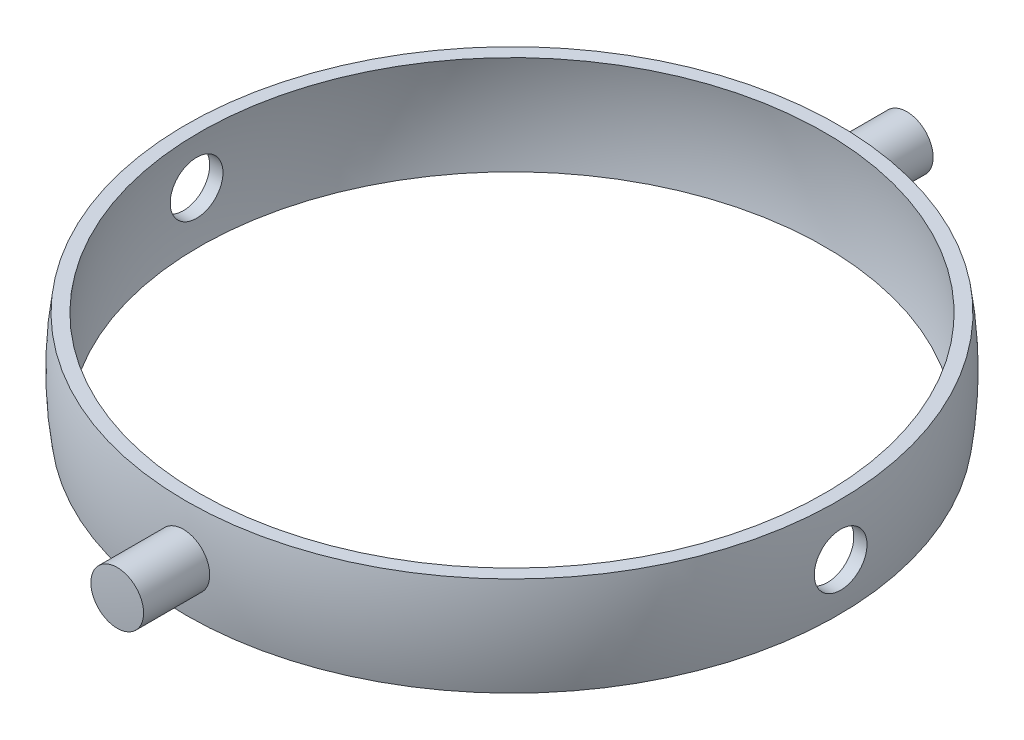
ISO-10303-21;
HEADER;
FILE_DESCRIPTION(('STEP AP214'),'2;1');
FILE_NAME('part.step','',(''),(''),'','','');
FILE_SCHEMA(('AUTOMOTIVE_DESIGN { 1 0 10303 214 1 1 1 1 }'));
ENDSEC;
DATA;
#1=APPLICATION_CONTEXT('core data for automotive mechanical design processes');
#2=APPLICATION_PROTOCOL_DEFINITION('international standard','automotive_design',2000,#1);
#3=PRODUCT_CONTEXT('',#1,'mechanical');
#4=PRODUCT('Part','Part','',(#3));
#5=PRODUCT_RELATED_PRODUCT_CATEGORY('part','',(#4));
#6=PRODUCT_DEFINITION_FORMATION('','',#4);
#7=PRODUCT_DEFINITION_CONTEXT('part definition',#1,'design');
#8=PRODUCT_DEFINITION('design','',#6,#7);
#9=PRODUCT_DEFINITION_SHAPE('','',#8);
#10=(LENGTH_UNIT() NAMED_UNIT(*) SI_UNIT(.MILLI.,.METRE.));
#11=(NAMED_UNIT(*) PLANE_ANGLE_UNIT() SI_UNIT($,.RADIAN.));
#12=(NAMED_UNIT(*) SI_UNIT($,.STERADIAN.) SOLID_ANGLE_UNIT());
#13=UNCERTAINTY_MEASURE_WITH_UNIT(LENGTH_MEASURE(1.E-05),#10,'distance_accuracy_value','');
#14=(GEOMETRIC_REPRESENTATION_CONTEXT(3) GLOBAL_UNCERTAINTY_ASSIGNED_CONTEXT((#13)) GLOBAL_UNIT_ASSIGNED_CONTEXT((#10,
#11,#12)) REPRESENTATION_CONTEXT('',''));
#15=CARTESIAN_POINT('',(0.,0.,0.));
#16=DIRECTION('',(0.,0.,1.));
#17=DIRECTION('',(1.,0.,0.));
#18=AXIS2_PLACEMENT_3D('',#15,#16,#17);
#19=CARTESIAN_POINT('',(0.,0.,0.));
#20=DIRECTION('',(0.,1.,0.));
#21=DIRECTION('',(-1.,0.,0.));
#22=AXIS2_PLACEMENT_3D('',#19,#20,#21);
#23=SPHERICAL_SURFACE('',#22,50.);
#24=CARTESIAN_POINT('',(0.,7.5,0.));
#25=DIRECTION('',(0.,1.,0.));
#26=DIRECTION('',(0.,0.,1.));
#27=AXIS2_PLACEMENT_3D('',#24,#25,#26);
#28=CIRCLE('',#27,49.434299833213);
#29=CARTESIAN_POINT('',(0.,7.5,49.434299833213));
#30=VERTEX_POINT('',#29);
#31=EDGE_CURVE('E79',#30,#30,#28,.T.);
#32=ORIENTED_EDGE('',*,*,#31,.F.);
#33=EDGE_LOOP('',(#32));
#34=FACE_BOUND('',#33,.T.);
#35=CARTESIAN_POINT('',(0.,-7.5,0.));
#36=DIRECTION('',(0.,1.,0.));
#37=DIRECTION('',(0.,0.,1.));
#38=AXIS2_PLACEMENT_3D('',#35,#36,#37);
#39=CIRCLE('',#38,49.434299833213);
#40=CARTESIAN_POINT('',(0.,-7.5,49.434299833213));
#41=VERTEX_POINT('',#40);
#42=EDGE_CURVE('E47',#41,#41,#39,.T.);
#43=ORIENTED_EDGE('',*,*,#42,.T.);
#44=EDGE_LOOP('',(#43));
#45=FACE_BOUND('',#44,.T.);
#46=CARTESIAN_POINT('',(-49.8397431775085,0.,0.));
#47=DIRECTION('',(1.,0.,0.));
#48=DIRECTION('',(0.,0.,-1.));
#49=AXIS2_PLACEMENT_3D('',#46,#47,#48);
#50=CIRCLE('',#49,4.);
#51=CARTESIAN_POINT('',(-49.8397431775085,0.,-4.));
#52=VERTEX_POINT('',#51);
#53=EDGE_CURVE('E72',#52,#52,#50,.F.);
#54=ORIENTED_EDGE('',*,*,#53,.F.);
#55=EDGE_LOOP('',(#54));
#56=FACE_BOUND('',#55,.T.);
#57=CARTESIAN_POINT('',(49.8397431775085,0.,0.));
#58=DIRECTION('',(-1.,0.,0.));
#59=DIRECTION('',(0.,0.,1.));
#60=AXIS2_PLACEMENT_3D('',#57,#58,#59);
#61=CIRCLE('',#60,4.);
#62=CARTESIAN_POINT('',(49.8397431775085,0.,4.));
#63=VERTEX_POINT('',#62);
#64=EDGE_CURVE('E75',#63,#63,#61,.F.);
#65=ORIENTED_EDGE('',*,*,#64,.F.);
#66=EDGE_LOOP('',(#65));
#67=FACE_BOUND('',#66,.T.);
#68=CARTESIAN_POINT('',(0.,0.,49.8397431775084));
#69=DIRECTION('',(0.,0.,-1.));
#70=DIRECTION('',(-1.,0.,0.));
#71=AXIS2_PLACEMENT_3D('',#68,#69,#70);
#72=CIRCLE('',#71,4.);
#73=CARTESIAN_POINT('',(-4.,0.,49.8397431775084));
#74=VERTEX_POINT('',#73);
#75=EDGE_CURVE('E11',#74,#74,#72,.F.);
#76=ORIENTED_EDGE('',*,*,#75,.F.);
#77=EDGE_LOOP('',(#76));
#78=FACE_BOUND('',#77,.T.);
#79=CARTESIAN_POINT('',(0.,0.,-49.8397431775085));
#80=DIRECTION('',(0.,0.,1.));
#81=DIRECTION('',(1.,0.,0.));
#82=AXIS2_PLACEMENT_3D('',#79,#80,#81);
#83=CIRCLE('',#82,4.);
#84=CARTESIAN_POINT('',(4.,0.,-49.8397431775085));
#85=VERTEX_POINT('',#84);
#86=EDGE_CURVE('E64',#85,#85,#83,.F.);
#87=ORIENTED_EDGE('',*,*,#86,.F.);
#88=EDGE_LOOP('',(#87));
#89=FACE_BOUND('',#88,.T.);
#90=ADVANCED_FACE('F39',(#34,#45,#56,#67,#78,#89),#23,.T.);
#91=CARTESIAN_POINT('',(-49.434299833213,-7.5,0.));
#92=DIRECTION('',(0.,-1.,0.));
#93=DIRECTION('',(0.,0.,-1.));
#94=AXIS2_PLACEMENT_3D('',#91,#92,#93);
#95=PLANE('',#94);
#96=CARTESIAN_POINT('',(0.,-7.49999999999999,0.));
#97=DIRECTION('',(0.,1.,0.));
#98=DIRECTION('',(0.,0.,1.));
#99=AXIS2_PLACEMENT_3D('',#96,#97,#98);
#100=CIRCLE('',#99,47.4104418878373);
#101=CARTESIAN_POINT('',(0.,-7.49999999999999,47.4104418878373));
#102=VERTEX_POINT('',#101);
#103=EDGE_CURVE('E85',#102,#102,#100,.T.);
#104=ORIENTED_EDGE('',*,*,#103,.T.);
#105=EDGE_LOOP('',(#104));
#106=FACE_BOUND('',#105,.T.);
#107=ORIENTED_EDGE('',*,*,#42,.F.);
#108=EDGE_LOOP('',(#107));
#109=FACE_BOUND('',#108,.T.);
#110=ADVANCED_FACE('F101',(#106,#109),#95,.T.);
#111=CARTESIAN_POINT('',(0.,0.,0.));
#112=DIRECTION('',(0.,1.,0.));
#113=DIRECTION('',(-1.,0.,0.));
#114=AXIS2_PLACEMENT_3D('',#111,#112,#113);
#115=SPHERICAL_SURFACE('',#114,48.);
#116=CARTESIAN_POINT('',(47.8330429724056,0.,0.));
#117=DIRECTION('',(-1.,0.,0.));
#118=DIRECTION('',(0.,0.,1.));
#119=AXIS2_PLACEMENT_3D('',#116,#117,#118);
#120=CIRCLE('',#119,4.);
#121=CARTESIAN_POINT('',(47.8330429724056,0.,4.));
#122=VERTEX_POINT('',#121);
#123=EDGE_CURVE('E76',#122,#122,#120,.T.);
#124=ORIENTED_EDGE('',*,*,#123,.F.);
#125=EDGE_LOOP('',(#124));
#126=FACE_BOUND('',#125,.T.);
#127=CARTESIAN_POINT('',(-47.8330429724056,0.,0.));
#128=DIRECTION('',(1.,0.,0.));
#129=DIRECTION('',(0.,0.,-1.));
#130=AXIS2_PLACEMENT_3D('',#127,#128,#129);
#131=CIRCLE('',#130,4.);
#132=CARTESIAN_POINT('',(-47.8330429724056,0.,-4.));
#133=VERTEX_POINT('',#132);
#134=EDGE_CURVE('E69',#133,#133,#131,.T.);
#135=ORIENTED_EDGE('',*,*,#134,.F.);
#136=EDGE_LOOP('',(#135));
#137=FACE_BOUND('',#136,.T.);
#138=CARTESIAN_POINT('',(0.,7.5,0.));
#139=DIRECTION('',(0.,1.,0.));
#140=DIRECTION('',(0.,0.,1.));
#141=AXIS2_PLACEMENT_3D('',#138,#139,#140);
#142=CIRCLE('',#141,47.4104418878373);
#143=CARTESIAN_POINT('',(0.,7.5,47.4104418878373));
#144=VERTEX_POINT('',#143);
#145=EDGE_CURVE('E82',#144,#144,#142,.T.);
#146=ORIENTED_EDGE('',*,*,#145,.T.);
#147=EDGE_LOOP('',(#146));
#148=FACE_BOUND('',#147,.T.);
#149=ORIENTED_EDGE('',*,*,#103,.F.);
#150=EDGE_LOOP('',(#149));
#151=FACE_BOUND('',#150,.T.);
#152=ADVANCED_FACE('F97',(#126,#137,#148,#151),#115,.F.);
#153=CARTESIAN_POINT('',(-49.434299833213,7.5,0.));
#154=DIRECTION('',(0.,1.,0.));
#155=DIRECTION('',(0.,0.,1.));
#156=AXIS2_PLACEMENT_3D('',#153,#154,#155);
#157=PLANE('',#156);
#158=ORIENTED_EDGE('',*,*,#31,.T.);
#159=EDGE_LOOP('',(#158));
#160=FACE_BOUND('',#159,.T.);
#161=ORIENTED_EDGE('',*,*,#145,.F.);
#162=EDGE_LOOP('',(#161));
#163=FACE_BOUND('',#162,.T.);
#164=ADVANCED_FACE('F100',(#160,#163),#157,.T.);
#165=CARTESIAN_POINT('',(-50.,0.,0.));
#166=DIRECTION('',(1.,0.,0.));
#167=DIRECTION('',(0.,0.,-1.));
#168=AXIS2_PLACEMENT_3D('',#165,#166,#167);
#169=CYLINDRICAL_SURFACE('',#168,4.);
#170=ORIENTED_EDGE('',*,*,#53,.T.);
#171=EDGE_LOOP('',(#170));
#172=FACE_BOUND('',#171,.T.);
#173=ORIENTED_EDGE('',*,*,#134,.T.);
#174=EDGE_LOOP('',(#173));
#175=FACE_BOUND('',#174,.T.);
#176=ADVANCED_FACE('F133',(#172,#175),#169,.F.);
#177=ORIENTED_EDGE('',*,*,#64,.T.);
#178=EDGE_LOOP('',(#177));
#179=FACE_BOUND('',#178,.T.);
#180=ORIENTED_EDGE('',*,*,#123,.T.);
#181=EDGE_LOOP('',(#180));
#182=FACE_BOUND('',#181,.T.);
#183=ADVANCED_FACE('F95',(#179,#182),#169,.F.);
#184=CARTESIAN_POINT('',(0.,0.,-50.001));
#185=DIRECTION('',(0.,0.,1.));
#186=DIRECTION('',(1.,0.,0.));
#187=AXIS2_PLACEMENT_3D('',#184,#185,#186);
#188=CYLINDRICAL_SURFACE('',#187,4.);
#189=CARTESIAN_POINT('',(0.,0.,59.866518188383));
#190=DIRECTION('',(0.,0.,-1.));
#191=DIRECTION('',(-1.,0.,0.));
#192=AXIS2_PLACEMENT_3D('',#189,#190,#191);
#193=CIRCLE('',#192,4.);
#194=CARTESIAN_POINT('',(-4.,0.,59.866518188383));
#195=VERTEX_POINT('',#194);
#196=EDGE_CURVE('E62',#195,#195,#193,.F.);
#197=ORIENTED_EDGE('',*,*,#196,.F.);
#198=EDGE_LOOP('',(#197));
#199=FACE_BOUND('',#198,.T.);
#200=ORIENTED_EDGE('',*,*,#75,.T.);
#201=EDGE_LOOP('',(#200));
#202=FACE_BOUND('',#201,.T.);
#203=ADVANCED_FACE('F125',(#199,#202),#188,.T.);
#204=CARTESIAN_POINT('',(0.,0.,60.001));
#205=DIRECTION('',(0.,0.,-1.));
#206=DIRECTION('',(-1.,0.,0.));
#207=AXIS2_PLACEMENT_3D('',#204,#205,#206);
#208=CYLINDRICAL_SURFACE('',#207,4.);
#209=CARTESIAN_POINT('',(0.,0.,-59.8665181883831));
#210=DIRECTION('',(0.,0.,1.));
#211=DIRECTION('',(1.,0.,0.));
#212=AXIS2_PLACEMENT_3D('',#209,#210,#211);
#213=CIRCLE('',#212,4.);
#214=CARTESIAN_POINT('',(4.,0.,-59.8665181883831));
#215=VERTEX_POINT('',#214);
#216=EDGE_CURVE('E42',#215,#215,#213,.T.);
#217=ORIENTED_EDGE('',*,*,#216,.T.);
#218=EDGE_LOOP('',(#217));
#219=FACE_BOUND('',#218,.T.);
#220=ORIENTED_EDGE('',*,*,#86,.T.);
#221=EDGE_LOOP('',(#220));
#222=FACE_BOUND('',#221,.T.);
#223=ADVANCED_FACE('F57',(#219,#222),#208,.T.);
#224=CARTESIAN_POINT('',(0.,0.,0.));
#225=DIRECTION('',(0.,1.,0.));
#226=DIRECTION('',(0.,0.,1.));
#227=AXIS2_PLACEMENT_3D('',#224,#225,#226);
#228=SPHERICAL_SURFACE('',#227,60.);
#229=CARTESIAN_POINT('',(0.,0.,-60.));
#230=VERTEX_POINT('',#229);
#231=VERTEX_LOOP('',#230);
#232=FACE_BOUND('',#231,.T.);
#233=ORIENTED_EDGE('',*,*,#216,.F.);
#234=EDGE_LOOP('',(#233));
#235=FACE_BOUND('',#234,.T.);
#236=ADVANCED_FACE('F53',(#232,#235),#228,.T.);
#237=CARTESIAN_POINT('',(0.,0.,60.));
#238=VERTEX_POINT('',#237);
#239=VERTEX_LOOP('',#238);
#240=FACE_BOUND('',#239,.T.);
#241=ORIENTED_EDGE('',*,*,#196,.T.);
#242=EDGE_LOOP('',(#241));
#243=FACE_BOUND('',#242,.T.);
#244=ADVANCED_FACE('F56',(#240,#243),#228,.T.);
#245=CLOSED_SHELL('',(#90,#110,#152,#164,#176,#183,#203,#223,#236,#244));
#246=MANIFOLD_SOLID_BREP('B2',#245);
#247=ADVANCED_BREP_SHAPE_REPRESENTATION('',(#18,#246),#14);
#248=SHAPE_DEFINITION_REPRESENTATION(#9,#247);
ENDSEC;
END-ISO-10303-21;
